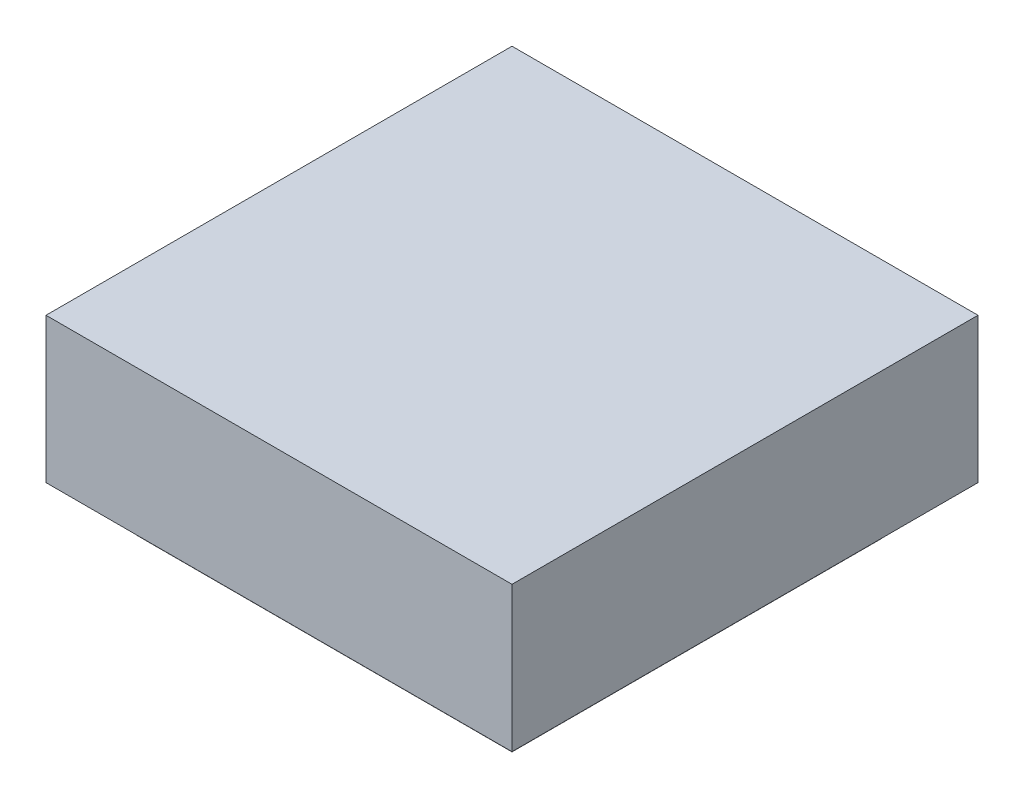
ISO-10303-21;
HEADER;
FILE_DESCRIPTION(('STEP AP214'),'2;1');
FILE_NAME('part.step','',(''),(''),'','','');
FILE_SCHEMA(('AUTOMOTIVE_DESIGN { 1 0 10303 214 1 1 1 1 }'));
ENDSEC;
DATA;
#1=APPLICATION_CONTEXT('core data for automotive mechanical design processes');
#2=APPLICATION_PROTOCOL_DEFINITION('international standard','automotive_design',2000,#1);
#3=PRODUCT_CONTEXT('',#1,'mechanical');
#4=PRODUCT('Part','Part','',(#3));
#5=PRODUCT_RELATED_PRODUCT_CATEGORY('part','',(#4));
#6=PRODUCT_DEFINITION_FORMATION('','',#4);
#7=PRODUCT_DEFINITION_CONTEXT('part definition',#1,'design');
#8=PRODUCT_DEFINITION('design','',#6,#7);
#9=PRODUCT_DEFINITION_SHAPE('','',#8);
#10=(LENGTH_UNIT() NAMED_UNIT(*) SI_UNIT(.MILLI.,.METRE.));
#11=(NAMED_UNIT(*) PLANE_ANGLE_UNIT() SI_UNIT($,.RADIAN.));
#12=(NAMED_UNIT(*) SI_UNIT($,.STERADIAN.) SOLID_ANGLE_UNIT());
#13=UNCERTAINTY_MEASURE_WITH_UNIT(LENGTH_MEASURE(1.E-05),#10,'distance_accuracy_value','');
#14=(GEOMETRIC_REPRESENTATION_CONTEXT(3) GLOBAL_UNCERTAINTY_ASSIGNED_CONTEXT((#13)) GLOBAL_UNIT_ASSIGNED_CONTEXT((#10,
#11,#12)) REPRESENTATION_CONTEXT('',''));
#15=CARTESIAN_POINT('',(0.,0.,0.));
#16=DIRECTION('',(0.,0.,1.));
#17=DIRECTION('',(1.,0.,0.));
#18=AXIS2_PLACEMENT_3D('',#15,#16,#17);
#19=CARTESIAN_POINT('',(-23.6466511849217,-23.646651184922,32.));
#20=DIRECTION('',(-0.707106781186544,-0.707106781186551,0.));
#21=DIRECTION('',(0.707106781186551,-0.707106781186544,0.));
#22=AXIS2_PLACEMENT_3D('',#19,#20,#21);
#23=PLANE('',#22);
#24=DIRECTION('',(-0.57735026918963,0.577350269189625,0.577350269189622));
#25=VECTOR('',#24,1.);
#26=CARTESIAN_POINT('',(-34.2576550036388,-13.035647366205,10.7779923625658));
#27=LINE('',#26,#25);
#28=CARTESIAN_POINT('',(-43.0030960555545,-4.29020631428937,19.5234334144814));
#29=VERTEX_POINT('',#28);
#30=CARTESIAN_POINT('',(-48.7955575285398,1.50225515869587,25.3158948874667));
#31=VERTEX_POINT('',#30);
#32=EDGE_CURVE('E327',#29,#31,#27,.T.);
#33=ORIENTED_EDGE('',*,*,#32,.T.);
#34=CARTESIAN_POINT('',(-53.4535049722732,6.16020260242914,16.));
#35=DIRECTION('',(-0.707106781186544,-0.707106781186551,0.));
#36=DIRECTION('',(0.707106781186551,-0.707106781186544,0.));
#37=AXIS2_PLACEMENT_3D('',#34,#35,#36);
#38=CIRCLE('',#37,11.4095944858479);
#39=CARTESIAN_POINT('',(-48.7922523416298,1.49895697903013,6.68740329219908));
#40=VERTEX_POINT('',#39);
#41=EDGE_CURVE('E187',#40,#31,#38,.T.);
#42=ORIENTED_EDGE('',*,*,#41,.F.);
#43=DIRECTION('',(0.577350269189631,-0.577350269189625,0.577350269189622));
#44=VECTOR('',#43,1.);
#45=CARTESIAN_POINT('',(-23.5909883369721,-23.7023140328716,31.8886743041007));
#46=LINE('',#45,#44);
#47=CARTESIAN_POINT('',(-43.0030960555545,-4.29020631428937,12.4765665855186));
#48=VERTEX_POINT('',#47);
#49=EDGE_CURVE('E243',#40,#48,#46,.T.);
#50=ORIENTED_EDGE('',*,*,#49,.T.);
#51=DIRECTION('',(0.,0.,-1.));
#52=VECTOR('',#51,1.);
#53=CARTESIAN_POINT('',(-43.0030960555545,-4.29020631428938,32.));
#54=LINE('',#53,#52);
#55=EDGE_CURVE('E283',#29,#48,#54,.T.);
#56=ORIENTED_EDGE('',*,*,#55,.F.);
#57=EDGE_LOOP('',(#33,#42,#50,#56));
#58=FACE_BOUND('',#57,.T.);
#59=ADVANCED_FACE('F34',(#58),#23,.T.);
#60=CARTESIAN_POINT('',(-55.4796626410733,8.18636027122924,0.));
#61=VERTEX_POINT('',#60);
#62=EDGE_CURVE('E245',#61,#40,#46,.T.);
#63=ORIENTED_EDGE('',*,*,#62,.T.);
#64=CARTESIAN_POINT('',(-53.4535049722732,6.16020260242914,4.59040551415211));
#65=VERTEX_POINT('',#64);
#66=EDGE_CURVE('E190',#65,#40,#38,.T.);
#67=ORIENTED_EDGE('',*,*,#66,.F.);
#68=DIRECTION('',(0.,0.,-1.));
#69=VECTOR('',#68,1.);
#70=CARTESIAN_POINT('',(-53.4535049722732,6.16020260242914,4.59040551415211));
#71=LINE('',#70,#69);
#72=CARTESIAN_POINT('',(-53.4535049722732,6.16020260242914,27.4095944858479));
#73=VERTEX_POINT('',#72);
#74=EDGE_CURVE('E174',#73,#65,#71,.T.);
#75=ORIENTED_EDGE('',*,*,#74,.F.);
#76=EDGE_CURVE('E178',#31,#73,#38,.T.);
#77=ORIENTED_EDGE('',*,*,#76,.F.);
#78=CARTESIAN_POINT('',(-48.913100003816,1.61979763397204,25.4334373627428));
#79=VERTEX_POINT('',#78);
#80=EDGE_CURVE('E325',#31,#79,#27,.T.);
#81=ORIENTED_EDGE('',*,*,#80,.T.);
#82=CARTESIAN_POINT('',(-55.4796626410733,8.18636027122924,32.));
#83=VERTEX_POINT('',#82);
#84=EDGE_CURVE('E323',#79,#83,#27,.T.);
#85=ORIENTED_EDGE('',*,*,#84,.T.);
#86=DIRECTION('',(-0.707106781186551,0.707106781186544,0.));
#87=VECTOR('',#86,1.);
#88=CARTESIAN_POINT('',(-23.6466511849217,-23.646651184922,32.));
#89=LINE('',#88,#87);
#90=CARTESIAN_POINT('',(-55.4830960555545,8.18979368571047,32.));
#91=VERTEX_POINT('',#90);
#92=EDGE_CURVE('E255',#83,#91,#89,.T.);
#93=ORIENTED_EDGE('',*,*,#92,.T.);
#94=DIRECTION('',(0.,0.,-1.));
#95=VECTOR('',#94,1.);
#96=CARTESIAN_POINT('',(-55.4830960555545,8.18979368571047,32.));
#97=LINE('',#96,#95);
#98=CARTESIAN_POINT('',(-55.4830960555545,8.18979368571047,0.));
#99=VERTEX_POINT('',#98);
#100=EDGE_CURVE('E286',#91,#99,#97,.T.);
#101=ORIENTED_EDGE('',*,*,#100,.T.);
#102=DIRECTION('',(-0.707106781186551,0.707106781186544,0.));
#103=VECTOR('',#102,1.);
#104=CARTESIAN_POINT('',(-23.6466511849217,-23.646651184922,0.));
#105=LINE('',#104,#103);
#106=EDGE_CURVE('E268',#61,#99,#105,.T.);
#107=ORIENTED_EDGE('',*,*,#106,.F.);
#108=EDGE_LOOP('',(#63,#67,#75,#77,#81,#85,#93,#101,#107));
#109=FACE_BOUND('',#108,.T.);
#110=ADVANCED_FACE('F322',(#109),#23,.T.);
#111=CARTESIAN_POINT('',(-56.4830960555545,-11.9068198643854,11.9068198643854));
#112=DIRECTION('',(0.,-0.707106781186546,0.707106781186549));
#113=DIRECTION('',(0.,-0.707106781186549,-0.707106781186546));
#114=AXIS2_PLACEMENT_3D('',#111,#112,#113);
#115=PLANE('',#114);
#116=DIRECTION('',(-0.577350269189631,-0.577350269189624,-0.577350269189622));
#117=VECTOR('',#116,1.);
#118=CARTESIAN_POINT('',(-18.384184127446,13.2852721993377,37.0989119281085));
#119=LINE('',#118,#117);
#120=CARTESIAN_POINT('',(-30.0496586928118,1.61979763397203,25.4334373627428));
#121=VERTEX_POINT('',#120);
#122=CARTESIAN_POINT('',(-30.1478745434648,1.52158178331895,25.3352215120897));
#123=VERTEX_POINT('',#122);
#124=EDGE_CURVE('E328',#121,#123,#119,.T.);
#125=ORIENTED_EDGE('',*,*,#124,.F.);
#126=CARTESIAN_POINT('',(-39.4813793483139,6.33565796172316,30.1492976904939));
#127=DIRECTION('',(0.,-0.707106781186546,0.707106781186549));
#128=DIRECTION('',(0.,-0.707106781186549,-0.707106781186546));
#129=AXIS2_PLACEMENT_3D('',#126,#127,#128);
#130=CIRCLE('',#129,11.5514515012244);
#131=EDGE_CURVE('E11',#121,#79,#130,.F.);
#132=ORIENTED_EDGE('',*,*,#131,.T.);
#133=ORIENTED_EDGE('',*,*,#80,.F.);
#134=ORIENTED_EDGE('',*,*,#32,.F.);
#135=DIRECTION('',(1.,0.,0.));
#136=VECTOR('',#135,1.);
#137=CARTESIAN_POINT('',(-56.4830960555545,-4.29020631428937,19.5234334144814));
#138=LINE('',#137,#136);
#139=CARTESIAN_POINT('',(-35.9596626410732,-4.29020631428938,19.5234334144814));
#140=VERTEX_POINT('',#139);
#141=EDGE_CURVE('E364',#29,#140,#138,.T.);
#142=ORIENTED_EDGE('',*,*,#141,.T.);
#143=EDGE_CURVE('E330',#123,#140,#119,.T.);
#144=ORIENTED_EDGE('',*,*,#143,.F.);
#145=EDGE_LOOP('',(#125,#132,#133,#134,#142,#144));
#146=FACE_BOUND('',#145,.T.);
#147=ADVANCED_FACE('F378',(#146),#115,.T.);
#148=ORIENTED_EDGE('',*,*,#84,.F.);
#149=CARTESIAN_POINT('',(-39.4813793483139,6.33565796172316,30.1492976904939));
#150=DIRECTION('',(0.,-0.707106781186546,0.707106781186549));
#151=DIRECTION('',(0.,-0.707106781186549,-0.707106781186546));
#152=AXIS2_PLACEMENT_3D('',#149,#150,#151);
#153=CIRCLE('',#152,11.5514515012244);
#154=CARTESIAN_POINT('',(-51.0328308495383,6.33565796172316,30.1492976904939));
#155=VERTEX_POINT('',#154);
#156=EDGE_CURVE('E180',#155,#79,#153,.T.);
#157=ORIENTED_EDGE('',*,*,#156,.F.);
#158=DIRECTION('',(1.,0.,0.));
#159=VECTOR('',#158,1.);
#160=CARTESIAN_POINT('',(0.,6.33565796172316,30.1492976904939));
#161=LINE('',#160,#159);
#162=CARTESIAN_POINT('',(-27.9299278470895,6.33565796172316,30.1492976904939));
#163=VERTEX_POINT('',#162);
#164=EDGE_CURVE('E60',#155,#163,#161,.T.);
#165=ORIENTED_EDGE('',*,*,#164,.T.);
#166=EDGE_CURVE('E44',#163,#121,#130,.F.);
#167=ORIENTED_EDGE('',*,*,#166,.T.);
#168=CARTESIAN_POINT('',(-23.4830960555545,8.18636027122923,32.));
#169=VERTEX_POINT('',#168);
#170=EDGE_CURVE('E304',#169,#121,#119,.T.);
#171=ORIENTED_EDGE('',*,*,#170,.F.);
#172=DIRECTION('',(1.,0.,0.));
#173=VECTOR('',#172,1.);
#174=CARTESIAN_POINT('',(0.,8.18636027122922,32.));
#175=LINE('',#174,#173);
#176=EDGE_CURVE('E241',#83,#169,#175,.T.);
#177=ORIENTED_EDGE('',*,*,#176,.F.);
#178=EDGE_LOOP('',(#148,#157,#165,#167,#171,#177));
#179=FACE_BOUND('',#178,.T.);
#180=ADVANCED_FACE('F380',(#179),#115,.T.);
#181=CARTESIAN_POINT('',(-15.8347281633917,15.8347281633919,32.));
#182=DIRECTION('',(0.707106781186544,-0.707106781186552,0.));
#183=DIRECTION('',(0.707106781186551,0.707106781186544,0.));
#184=AXIS2_PLACEMENT_3D('',#181,#182,#183);
#185=PLANE('',#184);
#186=DIRECTION('',(0.,0.,1.));
#187=VECTOR('',#186,1.);
#188=CARTESIAN_POINT('',(-25.48026378742,6.18919253936376,27.4332646702363));
#189=LINE('',#188,#187);
#190=CARTESIAN_POINT('',(-25.48026378742,6.18919253936376,4.56673532976368));
#191=VERTEX_POINT('',#190);
#192=CARTESIAN_POINT('',(-25.48026378742,6.18919253936376,27.4332646702363));
#193=VERTEX_POINT('',#192);
#194=EDGE_CURVE('E213',#191,#193,#189,.T.);
#195=ORIENTED_EDGE('',*,*,#194,.F.);
#196=CARTESIAN_POINT('',(-25.48026378742,6.18919253936376,16.));
#197=DIRECTION('',(0.707106781186544,-0.707106781186551,0.));
#198=DIRECTION('',(0.707106781186551,0.707106781186544,0.));
#199=AXIS2_PLACEMENT_3D('',#196,#197,#198);
#200=CIRCLE('',#199,11.4332646702363);
#201=CARTESIAN_POINT('',(-30.1478745434648,1.52158178331895,6.66477848791025));
#202=VERTEX_POINT('',#201);
#203=EDGE_CURVE('E208',#202,#191,#200,.T.);
#204=ORIENTED_EDGE('',*,*,#203,.F.);
#205=DIRECTION('',(0.577350269189631,0.577350269189624,-0.577350269189622));
#206=VECTOR('',#205,1.);
#207=CARTESIAN_POINT('',(-29.0508507941126,2.61860553267114,5.56775473855807));
#208=LINE('',#207,#206);
#209=CARTESIAN_POINT('',(-23.4830960555545,8.18636027122923,0.));
#210=VERTEX_POINT('',#209);
#211=EDGE_CURVE('E308',#202,#210,#208,.T.);
#212=ORIENTED_EDGE('',*,*,#211,.T.);
#213=DIRECTION('',(0.,0.,-1.));
#214=VECTOR('',#213,1.);
#215=CARTESIAN_POINT('',(-23.4830960555545,8.18636027122923,32.));
#216=LINE('',#215,#214);
#217=EDGE_CURVE('E278',#169,#210,#216,.T.);
#218=ORIENTED_EDGE('',*,*,#217,.F.);
#219=ORIENTED_EDGE('',*,*,#170,.T.);
#220=ORIENTED_EDGE('',*,*,#124,.T.);
#221=EDGE_CURVE('E216',#193,#123,#200,.T.);
#222=ORIENTED_EDGE('',*,*,#221,.F.);
#223=EDGE_LOOP('',(#195,#204,#212,#218,#219,#220,#222));
#224=FACE_BOUND('',#223,.T.);
#225=ADVANCED_FACE('F303',(#224),#185,.T.);
#226=CARTESIAN_POINT('',(-30.1770944765704,1.49236185021338,6.69399842101582));
#227=VERTEX_POINT('',#226);
#228=EDGE_CURVE('E340',#227,#202,#208,.T.);
#229=ORIENTED_EDGE('',*,*,#228,.T.);
#230=EDGE_CURVE('E219',#123,#202,#200,.T.);
#231=ORIENTED_EDGE('',*,*,#230,.F.);
#232=ORIENTED_EDGE('',*,*,#143,.T.);
#233=DIRECTION('',(0.,0.,-1.));
#234=VECTOR('',#233,1.);
#235=CARTESIAN_POINT('',(-35.9596626410732,-4.29020631428938,32.));
#236=LINE('',#235,#234);
#237=CARTESIAN_POINT('',(-35.9596626410732,-4.29020631428938,12.4765665855186));
#238=VERTEX_POINT('',#237);
#239=EDGE_CURVE('E281',#140,#238,#236,.T.);
#240=ORIENTED_EDGE('',*,*,#239,.T.);
#241=EDGE_CURVE('E246',#238,#227,#208,.T.);
#242=ORIENTED_EDGE('',*,*,#241,.T.);
#243=EDGE_LOOP('',(#229,#231,#232,#240,#242));
#244=FACE_BOUND('',#243,.T.);
#245=ADVANCED_FACE('F345',(#244),#185,.T.);
#246=CARTESIAN_POINT('',(-56.4830960555545,4.09318013561461,4.09318013561461));
#247=DIRECTION('',(0.,-0.707106781186546,-0.707106781186549));
#248=DIRECTION('',(0.,0.707106781186549,-0.707106781186546));
#249=AXIS2_PLACEMENT_3D('',#246,#247,#248);
#250=PLANE('',#249);
#251=CARTESIAN_POINT('',(-39.4813793483139,6.14450428608519,2.04185598514404));
#252=DIRECTION('',(0.,-0.707106781186546,-0.707106781186549));
#253=DIRECTION('',(0.,0.707106781186549,-0.707106781186546));
#254=AXIS2_PLACEMENT_3D('',#251,#252,#253);
#255=CIRCLE('',#254,11.3953751786342);
#256=CARTESIAN_POINT('',(-28.0860041696797,6.14450428608519,2.04185598514404));
#257=VERTEX_POINT('',#256);
#258=EDGE_CURVE('E225',#257,#227,#255,.T.);
#259=ORIENTED_EDGE('',*,*,#258,.F.);
#260=DIRECTION('',(1.,0.,0.));
#261=VECTOR('',#260,1.);
#262=CARTESIAN_POINT('',(-28.0860041696797,6.14450428608519,2.04185598514404));
#263=LINE('',#262,#261);
#264=CARTESIAN_POINT('',(-50.8767545269481,6.14450428608519,2.04185598514404));
#265=VERTEX_POINT('',#264);
#266=EDGE_CURVE('E230',#265,#257,#263,.T.);
#267=ORIENTED_EDGE('',*,*,#266,.F.);
#268=EDGE_CURVE('E238',#40,#265,#255,.T.);
#269=ORIENTED_EDGE('',*,*,#268,.F.);
#270=ORIENTED_EDGE('',*,*,#62,.F.);
#271=DIRECTION('',(1.,0.,0.));
#272=VECTOR('',#271,1.);
#273=CARTESIAN_POINT('',(0.,8.18636027122922,0.));
#274=LINE('',#273,#272);
#275=EDGE_CURVE('E289',#61,#210,#274,.T.);
#276=ORIENTED_EDGE('',*,*,#275,.T.);
#277=ORIENTED_EDGE('',*,*,#211,.F.);
#278=ORIENTED_EDGE('',*,*,#228,.F.);
#279=EDGE_LOOP('',(#259,#267,#269,#270,#276,#277,#278));
#280=FACE_BOUND('',#279,.T.);
#281=ADVANCED_FACE('F357',(#280),#250,.T.);
#282=CARTESIAN_POINT('',(0.,-4.29020631428938,32.));
#283=DIRECTION('',(0.,-1.,0.));
#284=DIRECTION('',(0.,0.,-1.));
#285=AXIS2_PLACEMENT_3D('',#282,#283,#284);
#286=PLANE('',#285);
#287=ORIENTED_EDGE('',*,*,#239,.F.);
#288=ORIENTED_EDGE('',*,*,#141,.F.);
#289=ORIENTED_EDGE('',*,*,#55,.T.);
#290=DIRECTION('',(1.,0.,0.));
#291=VECTOR('',#290,1.);
#292=CARTESIAN_POINT('',(-56.4830960555545,-4.29020631428937,12.4765665855186));
#293=LINE('',#292,#291);
#294=EDGE_CURVE('E332',#48,#238,#293,.T.);
#295=ORIENTED_EDGE('',*,*,#294,.T.);
#296=EDGE_LOOP('',(#287,#288,#289,#295));
#297=FACE_BOUND('',#296,.T.);
#298=ADVANCED_FACE('F392',(#297),#286,.T.);
#299=CARTESIAN_POINT('',(0.,0.,32.));
#300=DIRECTION('',(0.,0.,1.));
#301=DIRECTION('',(1.,0.,0.));
#302=AXIS2_PLACEMENT_3D('',#299,#300,#301);
#303=PLANE('',#302);
#304=ORIENTED_EDGE('',*,*,#92,.F.);
#305=ORIENTED_EDGE('',*,*,#176,.T.);
#306=DIRECTION('',(0.,-1.,0.));
#307=VECTOR('',#306,1.);
#308=CARTESIAN_POINT('',(-23.4830960555545,0.,32.));
#309=LINE('',#308,#307);
#310=CARTESIAN_POINT('',(-23.4830960555545,18.1412750358596,32.));
#311=VERTEX_POINT('',#310);
#312=EDGE_CURVE('E258',#311,#169,#309,.T.);
#313=ORIENTED_EDGE('',*,*,#312,.F.);
#314=DIRECTION('',(1.,0.,0.));
#315=VECTOR('',#314,1.);
#316=CARTESIAN_POINT('',(0.,18.1412750358596,32.));
#317=LINE('',#316,#315);
#318=CARTESIAN_POINT('',(-55.4830960555545,18.1412750358596,32.));
#319=VERTEX_POINT('',#318);
#320=EDGE_CURVE('E261',#319,#311,#317,.T.);
#321=ORIENTED_EDGE('',*,*,#320,.F.);
#322=DIRECTION('',(0.,-1.,0.));
#323=VECTOR('',#322,1.);
#324=CARTESIAN_POINT('',(-55.4830960555545,0.,32.));
#325=LINE('',#324,#323);
#326=EDGE_CURVE('E251',#319,#91,#325,.T.);
#327=ORIENTED_EDGE('',*,*,#326,.T.);
#328=EDGE_LOOP('',(#304,#305,#313,#321,#327));
#329=FACE_BOUND('',#328,.T.);
#330=ADVANCED_FACE('F297',(#329),#303,.T.);
#331=CARTESIAN_POINT('',(0.,0.,0.));
#332=DIRECTION('',(0.,0.,1.));
#333=DIRECTION('',(1.,0.,0.));
#334=AXIS2_PLACEMENT_3D('',#331,#332,#333);
#335=PLANE('',#334);
#336=ORIENTED_EDGE('',*,*,#275,.F.);
#337=ORIENTED_EDGE('',*,*,#106,.T.);
#338=DIRECTION('',(0.,-1.,0.));
#339=VECTOR('',#338,1.);
#340=CARTESIAN_POINT('',(-55.4830960555545,0.,0.));
#341=LINE('',#340,#339);
#342=CARTESIAN_POINT('',(-55.4830960555545,18.1412750358596,0.));
#343=VERTEX_POINT('',#342);
#344=EDGE_CURVE('E265',#343,#99,#341,.T.);
#345=ORIENTED_EDGE('',*,*,#344,.F.);
#346=DIRECTION('',(1.,0.,0.));
#347=VECTOR('',#346,1.);
#348=CARTESIAN_POINT('',(0.,18.1412750358596,0.));
#349=LINE('',#348,#347);
#350=CARTESIAN_POINT('',(-23.4830960555545,18.1412750358596,0.));
#351=VERTEX_POINT('',#350);
#352=EDGE_CURVE('E256',#343,#351,#349,.T.);
#353=ORIENTED_EDGE('',*,*,#352,.T.);
#354=DIRECTION('',(0.,-1.,0.));
#355=VECTOR('',#354,1.);
#356=CARTESIAN_POINT('',(-23.4830960555545,0.,0.));
#357=LINE('',#356,#355);
#358=EDGE_CURVE('E270',#351,#210,#357,.T.);
#359=ORIENTED_EDGE('',*,*,#358,.T.);
#360=EDGE_LOOP('',(#336,#337,#345,#353,#359));
#361=FACE_BOUND('',#360,.T.);
#362=ADVANCED_FACE('F402',(#361),#335,.F.);
#363=CARTESIAN_POINT('',(-55.4830960555545,0.,32.));
#364=DIRECTION('',(1.,0.,0.));
#365=DIRECTION('',(0.,1.,0.));
#366=AXIS2_PLACEMENT_3D('',#363,#364,#365);
#367=PLANE('',#366);
#368=ORIENTED_EDGE('',*,*,#344,.T.);
#369=ORIENTED_EDGE('',*,*,#100,.F.);
#370=ORIENTED_EDGE('',*,*,#326,.F.);
#371=DIRECTION('',(0.,0.,-1.));
#372=VECTOR('',#371,1.);
#373=CARTESIAN_POINT('',(-55.4830960555545,18.1412750358596,32.));
#374=LINE('',#373,#372);
#375=EDGE_CURVE('E264',#319,#343,#374,.T.);
#376=ORIENTED_EDGE('',*,*,#375,.T.);
#377=EDGE_LOOP('',(#368,#369,#370,#376));
#378=FACE_BOUND('',#377,.T.);
#379=ADVANCED_FACE('F36',(#378),#367,.F.);
#380=CARTESIAN_POINT('',(-23.4830960555545,0.,32.));
#381=DIRECTION('',(1.,0.,0.));
#382=DIRECTION('',(0.,1.,0.));
#383=AXIS2_PLACEMENT_3D('',#380,#381,#382);
#384=PLANE('',#383);
#385=ORIENTED_EDGE('',*,*,#358,.F.);
#386=DIRECTION('',(0.,0.,-1.));
#387=VECTOR('',#386,1.);
#388=CARTESIAN_POINT('',(-23.4830960555545,18.1412750358596,32.));
#389=LINE('',#388,#387);
#390=EDGE_CURVE('E276',#311,#351,#389,.T.);
#391=ORIENTED_EDGE('',*,*,#390,.F.);
#392=ORIENTED_EDGE('',*,*,#312,.T.);
#393=ORIENTED_EDGE('',*,*,#217,.T.);
#394=EDGE_LOOP('',(#385,#391,#392,#393));
#395=FACE_BOUND('',#394,.T.);
#396=ADVANCED_FACE('F311',(#395),#384,.T.);
#397=CARTESIAN_POINT('',(0.,18.1412750358596,32.));
#398=DIRECTION('',(0.,1.,0.));
#399=DIRECTION('',(0.,0.,1.));
#400=AXIS2_PLACEMENT_3D('',#397,#398,#399);
#401=PLANE('',#400);
#402=ORIENTED_EDGE('',*,*,#352,.F.);
#403=ORIENTED_EDGE('',*,*,#375,.F.);
#404=ORIENTED_EDGE('',*,*,#320,.T.);
#405=ORIENTED_EDGE('',*,*,#390,.T.);
#406=EDGE_LOOP('',(#402,#403,#404,#405));
#407=FACE_BOUND('',#406,.T.);
#408=ADVANCED_FACE('F314',(#407),#401,.T.);
#409=EDGE_CURVE('E38',#227,#40,#255,.T.);
#410=ORIENTED_EDGE('',*,*,#409,.F.);
#411=ORIENTED_EDGE('',*,*,#241,.F.);
#412=ORIENTED_EDGE('',*,*,#294,.F.);
#413=ORIENTED_EDGE('',*,*,#49,.F.);
#414=EDGE_LOOP('',(#410,#411,#412,#413));
#415=FACE_BOUND('',#414,.T.);
#416=ADVANCED_FACE('F401',(#415),#250,.T.);
#417=CARTESIAN_POINT('',(-39.4813793483139,6.13743321827332,2.03478491733217));
#418=DIRECTION('',(0.,0.707106781186546,0.707106781186549));
#419=DIRECTION('',(0.,-0.707106781186549,0.707106781186546));
#420=AXIS2_PLACEMENT_3D('',#417,#418,#419);
#421=CYLINDRICAL_SURFACE('',#420,11.3953751786342);
#422=ORIENTED_EDGE('',*,*,#258,.T.);
#423=ORIENTED_EDGE('',*,*,#409,.T.);
#424=ORIENTED_EDGE('',*,*,#268,.T.);
#425=DIRECTION('',(0.,0.707106781186546,0.707106781186549));
#426=VECTOR('',#425,1.);
#427=CARTESIAN_POINT('',(-50.8767545269481,6.13743321827332,2.03478491733217));
#428=LINE('',#427,#426);
#429=CARTESIAN_POINT('',(-50.8767545269481,6.13743321827332,2.03478491733217));
#430=VERTEX_POINT('',#429);
#431=EDGE_CURVE('E363',#430,#265,#428,.T.);
#432=ORIENTED_EDGE('',*,*,#431,.F.);
#433=CARTESIAN_POINT('',(-39.4813793483139,6.13743321827332,2.03478491733217));
#434=DIRECTION('',(0.,-0.707106781186546,-0.707106781186549));
#435=DIRECTION('',(0.,0.707106781186549,-0.707106781186546));
#436=AXIS2_PLACEMENT_3D('',#433,#434,#435);
#437=CIRCLE('',#436,11.3953751786342);
#438=CARTESIAN_POINT('',(-28.0860041696797,6.13743321827332,2.03478491733217));
#439=VERTEX_POINT('',#438);
#440=EDGE_CURVE('E226',#439,#430,#437,.T.);
#441=ORIENTED_EDGE('',*,*,#440,.F.);
#442=DIRECTION('',(0.,0.707106781186546,0.707106781186549));
#443=VECTOR('',#442,1.);
#444=CARTESIAN_POINT('',(-28.0860041696797,6.13743321827332,2.03478491733217));
#445=LINE('',#444,#443);
#446=EDGE_CURVE('E231',#439,#257,#445,.T.);
#447=ORIENTED_EDGE('',*,*,#446,.T.);
#448=EDGE_LOOP('',(#422,#423,#424,#432,#441,#447));
#449=FACE_BOUND('',#448,.T.);
#450=ADVANCED_FACE('F352',(#449),#421,.T.);
#451=CARTESIAN_POINT('',(-28.0860041696797,6.13743321827332,2.03478491733217));
#452=DIRECTION('',(0.,-0.707106781186549,0.707106781186546));
#453=DIRECTION('',(0.,-0.707106781186546,-0.707106781186549));
#454=AXIS2_PLACEMENT_3D('',#451,#452,#453);
#455=PLANE('',#454);
#456=ORIENTED_EDGE('',*,*,#266,.T.);
#457=ORIENTED_EDGE('',*,*,#446,.F.);
#458=DIRECTION('',(1.,0.,0.));
#459=VECTOR('',#458,1.);
#460=CARTESIAN_POINT('',(-28.0860041696797,6.13743321827332,2.03478491733217));
#461=LINE('',#460,#459);
#462=EDGE_CURVE('E229',#430,#439,#461,.T.);
#463=ORIENTED_EDGE('',*,*,#462,.F.);
#464=ORIENTED_EDGE('',*,*,#431,.T.);
#465=EDGE_LOOP('',(#456,#457,#463,#464));
#466=FACE_BOUND('',#465,.T.);
#467=ADVANCED_FACE('F361',(#466),#455,.F.);
#468=CARTESIAN_POINT('',(-39.4813793483139,6.13743321827332,2.03478491733217));
#469=DIRECTION('',(0.,-0.707106781186546,-0.707106781186549));
#470=DIRECTION('',(0.,0.707106781186549,-0.707106781186546));
#471=AXIS2_PLACEMENT_3D('',#468,#469,#470);
#472=PLANE('',#471);
#473=ORIENTED_EDGE('',*,*,#440,.T.);
#474=ORIENTED_EDGE('',*,*,#462,.T.);
#475=EDGE_LOOP('',(#473,#474));
#476=FACE_BOUND('',#475,.T.);
#477=ADVANCED_FACE('F458',(#476),#472,.T.);
#478=CARTESIAN_POINT('',(-25.4731927196081,6.18212147155189,16.));
#479=DIRECTION('',(-0.707106781186544,0.707106781186551,0.));
#480=DIRECTION('',(-0.707106781186551,-0.707106781186544,0.));
#481=AXIS2_PLACEMENT_3D('',#478,#479,#480);
#482=CYLINDRICAL_SURFACE('',#481,11.4332646702363);
#483=ORIENTED_EDGE('',*,*,#221,.T.);
#484=ORIENTED_EDGE('',*,*,#230,.T.);
#485=ORIENTED_EDGE('',*,*,#203,.T.);
#486=DIRECTION('',(-0.707106781186544,0.707106781186551,0.));
#487=VECTOR('',#486,1.);
#488=CARTESIAN_POINT('',(-25.4731927196081,6.18212147155189,4.56673532976368));
#489=LINE('',#488,#487);
#490=CARTESIAN_POINT('',(-25.4731927196081,6.18212147155189,4.56673532976368));
#491=VERTEX_POINT('',#490);
#492=EDGE_CURVE('E223',#491,#191,#489,.T.);
#493=ORIENTED_EDGE('',*,*,#492,.F.);
#494=CARTESIAN_POINT('',(-25.4731927196081,6.18212147155189,16.));
#495=DIRECTION('',(0.707106781186544,-0.707106781186551,0.));
#496=DIRECTION('',(0.707106781186551,0.707106781186544,0.));
#497=AXIS2_PLACEMENT_3D('',#494,#495,#496);
#498=CIRCLE('',#497,11.4332646702363);
#499=CARTESIAN_POINT('',(-25.4731927196081,6.18212147155189,27.4332646702363));
#500=VERTEX_POINT('',#499);
#501=EDGE_CURVE('E209',#500,#491,#498,.T.);
#502=ORIENTED_EDGE('',*,*,#501,.F.);
#503=DIRECTION('',(-0.707106781186544,0.707106781186551,0.));
#504=VECTOR('',#503,1.);
#505=CARTESIAN_POINT('',(-25.4731927196081,6.18212147155189,27.4332646702363));
#506=LINE('',#505,#504);
#507=EDGE_CURVE('E215',#500,#193,#506,.T.);
#508=ORIENTED_EDGE('',*,*,#507,.T.);
#509=EDGE_LOOP('',(#483,#484,#485,#493,#502,#508));
#510=FACE_BOUND('',#509,.T.);
#511=ADVANCED_FACE('F374',(#510),#482,.T.);
#512=CARTESIAN_POINT('',(-25.4731927196081,6.18212147155189,27.4332646702363));
#513=DIRECTION('',(-0.707106781186552,-0.707106781186544,0.));
#514=DIRECTION('',(0.707106781186544,-0.707106781186551,0.));
#515=AXIS2_PLACEMENT_3D('',#512,#513,#514);
#516=PLANE('',#515);
#517=ORIENTED_EDGE('',*,*,#194,.T.);
#518=ORIENTED_EDGE('',*,*,#507,.F.);
#519=DIRECTION('',(0.,0.,1.));
#520=VECTOR('',#519,1.);
#521=CARTESIAN_POINT('',(-25.4731927196081,6.18212147155189,27.4332646702363));
#522=LINE('',#521,#520);
#523=EDGE_CURVE('E212',#491,#500,#522,.T.);
#524=ORIENTED_EDGE('',*,*,#523,.F.);
#525=ORIENTED_EDGE('',*,*,#492,.T.);
#526=EDGE_LOOP('',(#517,#518,#524,#525));
#527=FACE_BOUND('',#526,.T.);
#528=ADVANCED_FACE('F440',(#527),#516,.F.);
#529=CARTESIAN_POINT('',(-25.4731927196081,6.18212147155189,16.));
#530=DIRECTION('',(0.707106781186544,-0.707106781186551,0.));
#531=DIRECTION('',(0.707106781186551,0.707106781186544,0.));
#532=AXIS2_PLACEMENT_3D('',#529,#530,#531);
#533=PLANE('',#532);
#534=ORIENTED_EDGE('',*,*,#501,.T.);
#535=ORIENTED_EDGE('',*,*,#523,.T.);
#536=EDGE_LOOP('',(#534,#535));
#537=FACE_BOUND('',#536,.T.);
#538=ADVANCED_FACE('F435',(#537),#533,.T.);
#539=CARTESIAN_POINT('',(-39.4813793483139,6.3285868939113,30.1563687583058));
#540=DIRECTION('',(0.,0.707106781186546,-0.707106781186549));
#541=DIRECTION('',(0.,0.707106781186549,0.707106781186546));
#542=AXIS2_PLACEMENT_3D('',#539,#540,#541);
#543=CYLINDRICAL_SURFACE('',#542,11.5514515012244);
#544=ORIENTED_EDGE('',*,*,#156,.T.);
#545=ORIENTED_EDGE('',*,*,#131,.F.);
#546=ORIENTED_EDGE('',*,*,#166,.F.);
#547=DIRECTION('',(0.,0.707106781186546,-0.707106781186549));
#548=VECTOR('',#547,1.);
#549=CARTESIAN_POINT('',(-27.9299278470895,6.32858689391129,30.1563687583058));
#550=LINE('',#549,#548);
#551=CARTESIAN_POINT('',(-27.9299278470895,6.32858689391129,30.1563687583058));
#552=VERTEX_POINT('',#551);
#553=EDGE_CURVE('E205',#552,#163,#550,.T.);
#554=ORIENTED_EDGE('',*,*,#553,.F.);
#555=CARTESIAN_POINT('',(-39.4813793483139,6.3285868939113,30.1563687583058));
#556=DIRECTION('',(0.,-0.707106781186546,0.707106781186549));
#557=DIRECTION('',(0.,-0.707106781186549,-0.707106781186546));
#558=AXIS2_PLACEMENT_3D('',#555,#556,#557);
#559=CIRCLE('',#558,11.5514515012244);
#560=CARTESIAN_POINT('',(-51.0328308495383,6.3285868939113,30.1563687583058));
#561=VERTEX_POINT('',#560);
#562=EDGE_CURVE('E196',#561,#552,#559,.T.);
#563=ORIENTED_EDGE('',*,*,#562,.F.);
#564=DIRECTION('',(0.,0.707106781186546,-0.707106781186549));
#565=VECTOR('',#564,1.);
#566=CARTESIAN_POINT('',(-51.0328308495383,6.3285868939113,30.1563687583058));
#567=LINE('',#566,#565);
#568=EDGE_CURVE('E200',#561,#155,#567,.T.);
#569=ORIENTED_EDGE('',*,*,#568,.T.);
#570=EDGE_LOOP('',(#544,#545,#546,#554,#563,#569));
#571=FACE_BOUND('',#570,.T.);
#572=ADVANCED_FACE('F439',(#571),#543,.T.);
#573=CARTESIAN_POINT('',(0.,6.32858689391129,30.1563687583058));
#574=DIRECTION('',(0.,0.707106781186549,0.707106781186546));
#575=DIRECTION('',(0.,-0.707106781186546,0.707106781186549));
#576=AXIS2_PLACEMENT_3D('',#573,#574,#575);
#577=PLANE('',#576);
#578=ORIENTED_EDGE('',*,*,#164,.F.);
#579=ORIENTED_EDGE('',*,*,#568,.F.);
#580=DIRECTION('',(1.,0.,0.));
#581=VECTOR('',#580,1.);
#582=CARTESIAN_POINT('',(0.,6.32858689391129,30.1563687583058));
#583=LINE('',#582,#581);
#584=EDGE_CURVE('E198',#561,#552,#583,.T.);
#585=ORIENTED_EDGE('',*,*,#584,.T.);
#586=ORIENTED_EDGE('',*,*,#553,.T.);
#587=EDGE_LOOP('',(#578,#579,#585,#586));
#588=FACE_BOUND('',#587,.T.);
#589=ADVANCED_FACE('F514',(#588),#577,.T.);
#590=CARTESIAN_POINT('',(0.,-11.9138909321973,11.9138909321973));
#591=DIRECTION('',(0.,-0.707106781186546,0.707106781186549));
#592=DIRECTION('',(0.,-0.707106781186549,-0.707106781186546));
#593=AXIS2_PLACEMENT_3D('',#590,#591,#592);
#594=PLANE('',#593);
#595=ORIENTED_EDGE('',*,*,#562,.T.);
#596=ORIENTED_EDGE('',*,*,#584,.F.);
#597=EDGE_LOOP('',(#595,#596));
#598=FACE_BOUND('',#597,.T.);
#599=ADVANCED_FACE('F490',(#598),#594,.T.);
#600=CARTESIAN_POINT('',(-53.460576040085,6.15313153461728,16.));
#601=DIRECTION('',(0.707106781186544,0.707106781186551,0.));
#602=DIRECTION('',(-0.707106781186551,0.707106781186544,0.));
#603=AXIS2_PLACEMENT_3D('',#600,#601,#602);
#604=CYLINDRICAL_SURFACE('',#603,11.4095944858479);
#605=ORIENTED_EDGE('',*,*,#66,.T.);
#606=ORIENTED_EDGE('',*,*,#41,.T.);
#607=ORIENTED_EDGE('',*,*,#76,.T.);
#608=DIRECTION('',(0.707106781186544,0.707106781186551,0.));
#609=VECTOR('',#608,1.);
#610=CARTESIAN_POINT('',(-53.460576040085,6.15313153461728,27.4095944858479));
#611=LINE('',#610,#609);
#612=CARTESIAN_POINT('',(-53.460576040085,6.15313153461728,27.4095944858479));
#613=VERTEX_POINT('',#612);
#614=EDGE_CURVE('E52',#613,#73,#611,.T.);
#615=ORIENTED_EDGE('',*,*,#614,.F.);
#616=CARTESIAN_POINT('',(-53.460576040085,6.15313153461728,16.));
#617=DIRECTION('',(-0.707106781186544,-0.707106781186551,0.));
#618=DIRECTION('',(0.707106781186551,-0.707106781186544,0.));
#619=AXIS2_PLACEMENT_3D('',#616,#617,#618);
#620=CIRCLE('',#619,11.4095944858479);
#621=CARTESIAN_POINT('',(-53.460576040085,6.15313153461728,4.59040551415211));
#622=VERTEX_POINT('',#621);
#623=EDGE_CURVE('E170',#622,#613,#620,.T.);
#624=ORIENTED_EDGE('',*,*,#623,.F.);
#625=DIRECTION('',(0.707106781186544,0.707106781186551,0.));
#626=VECTOR('',#625,1.);
#627=CARTESIAN_POINT('',(-53.460576040085,6.15313153461728,4.59040551415211));
#628=LINE('',#627,#626);
#629=EDGE_CURVE('E167',#622,#65,#628,.T.);
#630=ORIENTED_EDGE('',*,*,#629,.T.);
#631=EDGE_LOOP('',(#605,#606,#607,#615,#624,#630));
#632=FACE_BOUND('',#631,.T.);
#633=ADVANCED_FACE('F176',(#632),#604,.T.);
#634=CARTESIAN_POINT('',(-53.460576040085,6.15313153461728,4.59040551415211));
#635=DIRECTION('',(0.707106781186551,-0.707106781186544,0.));
#636=DIRECTION('',(0.707106781186544,0.707106781186551,0.));
#637=AXIS2_PLACEMENT_3D('',#634,#635,#636);
#638=PLANE('',#637);
#639=ORIENTED_EDGE('',*,*,#74,.T.);
#640=ORIENTED_EDGE('',*,*,#629,.F.);
#641=DIRECTION('',(0.,0.,-1.));
#642=VECTOR('',#641,1.);
#643=CARTESIAN_POINT('',(-53.460576040085,6.15313153461728,4.59040551415211));
#644=LINE('',#643,#642);
#645=EDGE_CURVE('E163',#613,#622,#644,.T.);
#646=ORIENTED_EDGE('',*,*,#645,.F.);
#647=ORIENTED_EDGE('',*,*,#614,.T.);
#648=EDGE_LOOP('',(#639,#640,#646,#647));
#649=FACE_BOUND('',#648,.T.);
#650=ADVANCED_FACE('F165',(#649),#638,.F.);
#651=CARTESIAN_POINT('',(-53.460576040085,6.15313153461728,16.));
#652=DIRECTION('',(-0.707106781186544,-0.707106781186551,0.));
#653=DIRECTION('',(0.707106781186551,-0.707106781186544,0.));
#654=AXIS2_PLACEMENT_3D('',#651,#652,#653);
#655=PLANE('',#654);
#656=ORIENTED_EDGE('',*,*,#623,.T.);
#657=ORIENTED_EDGE('',*,*,#645,.T.);
#658=EDGE_LOOP('',(#656,#657));
#659=FACE_BOUND('',#658,.T.);
#660=ADVANCED_FACE('F172',(#659),#655,.T.);
#661=CLOSED_SHELL('',(#59,#110,#147,#180,#225,#245,#281,#298,#330,#362,#379,#396,#408,#416,#450,
#467,#477,#511,#528,#538,#572,#589,#599,#633,#650,#660));
#662=MANIFOLD_SOLID_BREP('B2',#661);
#663=ADVANCED_BREP_SHAPE_REPRESENTATION('',(#18,#662),#14);
#664=SHAPE_DEFINITION_REPRESENTATION(#9,#663);
ENDSEC;
END-ISO-10303-21;
